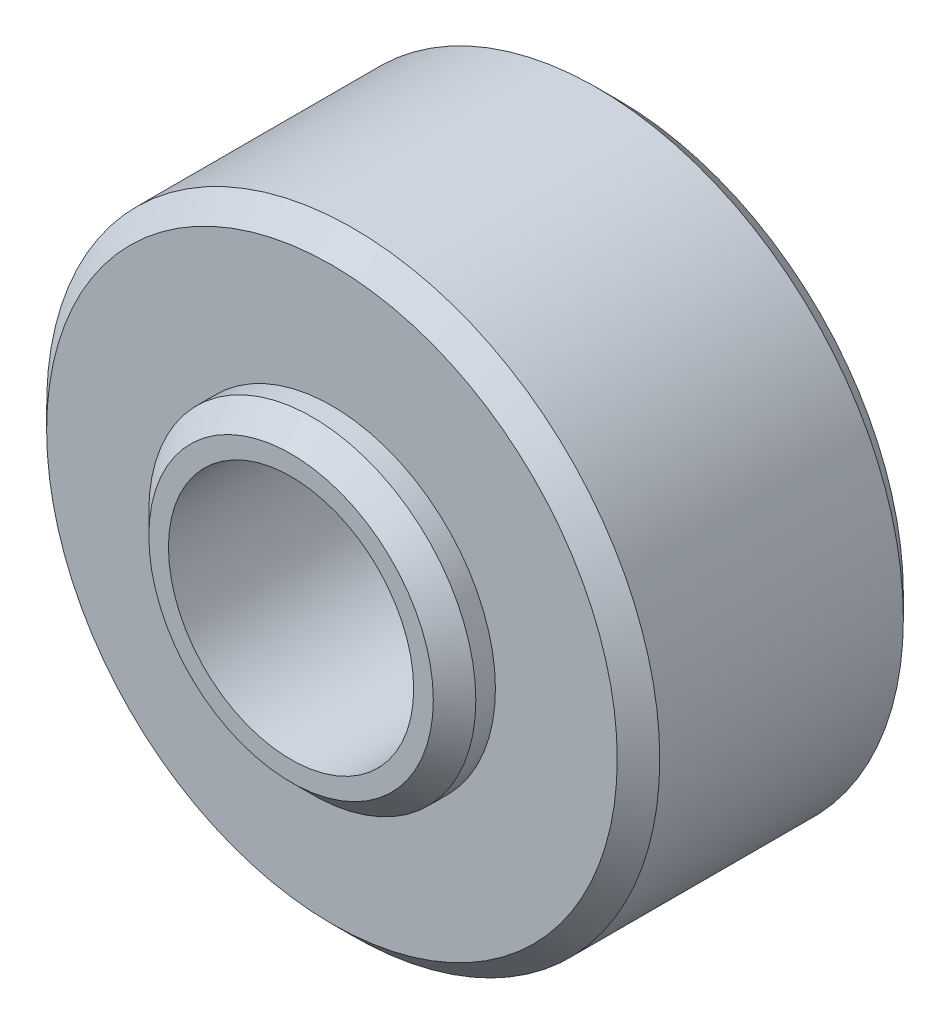
ISO-10303-21;
HEADER;
FILE_DESCRIPTION(('STEP AP214'),'2;1');
FILE_NAME('part.step','',(''),(''),'','','');
FILE_SCHEMA(('AUTOMOTIVE_DESIGN { 1 0 10303 214 1 1 1 1 }'));
ENDSEC;
DATA;
#1=APPLICATION_CONTEXT('core data for automotive mechanical design processes');
#2=APPLICATION_PROTOCOL_DEFINITION('international standard','automotive_design',2000,#1);
#3=PRODUCT_CONTEXT('',#1,'mechanical');
#4=PRODUCT('Part','Part','',(#3));
#5=PRODUCT_RELATED_PRODUCT_CATEGORY('part','',(#4));
#6=PRODUCT_DEFINITION_FORMATION('','',#4);
#7=PRODUCT_DEFINITION_CONTEXT('part definition',#1,'design');
#8=PRODUCT_DEFINITION('design','',#6,#7);
#9=PRODUCT_DEFINITION_SHAPE('','',#8);
#10=(LENGTH_UNIT() NAMED_UNIT(*) SI_UNIT(.MILLI.,.METRE.));
#11=(NAMED_UNIT(*) PLANE_ANGLE_UNIT() SI_UNIT($,.RADIAN.));
#12=(NAMED_UNIT(*) SI_UNIT($,.STERADIAN.) SOLID_ANGLE_UNIT());
#13=UNCERTAINTY_MEASURE_WITH_UNIT(LENGTH_MEASURE(1.E-05),#10,'distance_accuracy_value','');
#14=(GEOMETRIC_REPRESENTATION_CONTEXT(3) GLOBAL_UNCERTAINTY_ASSIGNED_CONTEXT((#13)) GLOBAL_UNIT_ASSIGNED_CONTEXT((#10,
#11,#12)) REPRESENTATION_CONTEXT('',''));
#15=CARTESIAN_POINT('',(0.,0.,0.));
#16=DIRECTION('',(0.,0.,1.));
#17=DIRECTION('',(1.,0.,0.));
#18=AXIS2_PLACEMENT_3D('',#15,#16,#17);
#19=CARTESIAN_POINT('',(0.,0.,7.));
#20=DIRECTION('',(0.,0.,-1.));
#21=DIRECTION('',(-1.,0.,0.));
#22=AXIS2_PLACEMENT_3D('',#19,#20,#21);
#23=CYLINDRICAL_SURFACE('',#22,7.5);
#24=CARTESIAN_POINT('',(0.,0.,6.48));
#25=DIRECTION('',(0.,0.,1.));
#26=DIRECTION('',(1.,0.,0.));
#27=AXIS2_PLACEMENT_3D('',#24,#25,#26);
#28=CIRCLE('',#27,7.5);
#29=CARTESIAN_POINT('',(7.5,0.,6.48));
#30=VERTEX_POINT('',#29);
#31=EDGE_CURVE('E10',#30,#30,#28,.F.);
#32=ORIENTED_EDGE('',*,*,#31,.T.);
#33=EDGE_LOOP('',(#32));
#34=FACE_BOUND('',#33,.T.);
#35=CARTESIAN_POINT('',(0.,0.,0.520000000000003));
#36=DIRECTION('',(0.,0.,1.));
#37=DIRECTION('',(1.,0.,0.));
#38=AXIS2_PLACEMENT_3D('',#35,#36,#37);
#39=CIRCLE('',#38,7.5);
#40=CARTESIAN_POINT('',(7.5,0.,0.520000000000003));
#41=VERTEX_POINT('',#40);
#42=EDGE_CURVE('E42',#41,#41,#39,.T.);
#43=ORIENTED_EDGE('',*,*,#42,.T.);
#44=EDGE_LOOP('',(#43));
#45=FACE_BOUND('',#44,.T.);
#46=ADVANCED_FACE('F34',(#34,#45),#23,.T.);
#47=CARTESIAN_POINT('',(0.,0.,7.));
#48=DIRECTION('',(0.,0.,1.));
#49=DIRECTION('',(1.,0.,0.));
#50=AXIS2_PLACEMENT_3D('',#47,#48,#49);
#51=PLANE('',#50);
#52=CARTESIAN_POINT('',(0.,0.,7.));
#53=DIRECTION('',(0.,0.,1.));
#54=DIRECTION('',(1.,0.,0.));
#55=AXIS2_PLACEMENT_3D('',#52,#53,#54);
#56=CIRCLE('',#55,6.97999999999999);
#57=CARTESIAN_POINT('',(6.97999999999999,0.,7.));
#58=VERTEX_POINT('',#57);
#59=EDGE_CURVE('E46',#58,#58,#56,.T.);
#60=ORIENTED_EDGE('',*,*,#59,.T.);
#61=EDGE_LOOP('',(#60));
#62=FACE_BOUND('',#61,.T.);
#63=CARTESIAN_POINT('',(0.,0.,7.));
#64=DIRECTION('',(0.,0.,1.));
#65=DIRECTION('',(1.,0.,0.));
#66=AXIS2_PLACEMENT_3D('',#63,#64,#65);
#67=CIRCLE('',#66,4.);
#68=CARTESIAN_POINT('',(4.,0.,7.));
#69=VERTEX_POINT('',#68);
#70=EDGE_CURVE('E67',#69,#69,#67,.T.);
#71=ORIENTED_EDGE('',*,*,#70,.F.);
#72=EDGE_LOOP('',(#71));
#73=FACE_BOUND('',#72,.T.);
#74=ADVANCED_FACE('F92',(#62,#73),#51,.T.);
#75=CARTESIAN_POINT('',(0.,0.,0.));
#76=DIRECTION('',(0.,0.,1.));
#77=DIRECTION('',(1.,0.,0.));
#78=AXIS2_PLACEMENT_3D('',#75,#76,#77);
#79=PLANE('',#78);
#80=CARTESIAN_POINT('',(0.,0.,0.));
#81=DIRECTION('',(0.,0.,1.));
#82=DIRECTION('',(1.,0.,0.));
#83=AXIS2_PLACEMENT_3D('',#80,#81,#82);
#84=CIRCLE('',#83,3.52000000000001);
#85=CARTESIAN_POINT('',(3.52000000000001,0.,0.));
#86=VERTEX_POINT('',#85);
#87=EDGE_CURVE('E61',#86,#86,#84,.T.);
#88=ORIENTED_EDGE('',*,*,#87,.T.);
#89=EDGE_LOOP('',(#88));
#90=FACE_BOUND('',#89,.T.);
#91=CARTESIAN_POINT('',(0.,0.,0.));
#92=DIRECTION('',(0.,0.,1.));
#93=DIRECTION('',(1.,0.,0.));
#94=AXIS2_PLACEMENT_3D('',#91,#92,#93);
#95=CIRCLE('',#94,6.98);
#96=CARTESIAN_POINT('',(6.98,0.,0.));
#97=VERTEX_POINT('',#96);
#98=EDGE_CURVE('E64',#97,#97,#95,.F.);
#99=ORIENTED_EDGE('',*,*,#98,.T.);
#100=EDGE_LOOP('',(#99));
#101=FACE_BOUND('',#100,.T.);
#102=ADVANCED_FACE('F88',(#90,#101),#79,.F.);
#103=CARTESIAN_POINT('',(0.,0.,8.));
#104=DIRECTION('',(0.,0.,-1.));
#105=DIRECTION('',(-1.,0.,0.));
#106=AXIS2_PLACEMENT_3D('',#103,#104,#105);
#107=CYLINDRICAL_SURFACE('',#106,4.);
#108=CARTESIAN_POINT('',(0.,0.,7.48));
#109=DIRECTION('',(0.,0.,1.));
#110=DIRECTION('',(1.,0.,0.));
#111=AXIS2_PLACEMENT_3D('',#108,#109,#110);
#112=CIRCLE('',#111,4.);
#113=CARTESIAN_POINT('',(4.,0.,7.48));
#114=VERTEX_POINT('',#113);
#115=EDGE_CURVE('E50',#114,#114,#112,.F.);
#116=ORIENTED_EDGE('',*,*,#115,.T.);
#117=EDGE_LOOP('',(#116));
#118=FACE_BOUND('',#117,.T.);
#119=ORIENTED_EDGE('',*,*,#70,.T.);
#120=EDGE_LOOP('',(#119));
#121=FACE_BOUND('',#120,.T.);
#122=ADVANCED_FACE('F78',(#118,#121),#107,.T.);
#123=CARTESIAN_POINT('',(0.,0.,8.));
#124=DIRECTION('',(0.,0.,1.));
#125=DIRECTION('',(1.,0.,0.));
#126=AXIS2_PLACEMENT_3D('',#123,#124,#125);
#127=PLANE('',#126);
#128=CARTESIAN_POINT('',(0.,0.,8.));
#129=DIRECTION('',(0.,0.,1.));
#130=DIRECTION('',(1.,0.,0.));
#131=AXIS2_PLACEMENT_3D('',#128,#129,#130);
#132=CIRCLE('',#131,3.48);
#133=CARTESIAN_POINT('',(3.48,0.,8.));
#134=VERTEX_POINT('',#133);
#135=EDGE_CURVE('E55',#134,#134,#132,.T.);
#136=ORIENTED_EDGE('',*,*,#135,.T.);
#137=EDGE_LOOP('',(#136));
#138=FACE_BOUND('',#137,.T.);
#139=CARTESIAN_POINT('',(0.,0.,8.));
#140=DIRECTION('',(0.,0.,1.));
#141=DIRECTION('',(1.,0.,0.));
#142=AXIS2_PLACEMENT_3D('',#139,#140,#141);
#143=CIRCLE('',#142,3.);
#144=CARTESIAN_POINT('',(3.,0.,8.));
#145=VERTEX_POINT('',#144);
#146=EDGE_CURVE('E70',#145,#145,#143,.T.);
#147=ORIENTED_EDGE('',*,*,#146,.F.);
#148=EDGE_LOOP('',(#147));
#149=FACE_BOUND('',#148,.T.);
#150=ADVANCED_FACE('F76',(#138,#149),#127,.T.);
#151=CARTESIAN_POINT('',(0.,0.,0.));
#152=DIRECTION('',(0.,0.,1.));
#153=DIRECTION('',(1.,0.,0.));
#154=AXIS2_PLACEMENT_3D('',#151,#152,#153);
#155=CYLINDRICAL_SURFACE('',#154,3.);
#156=CARTESIAN_POINT('',(0.,0.,0.520000000000004));
#157=DIRECTION('',(0.,0.,1.));
#158=DIRECTION('',(1.,0.,0.));
#159=AXIS2_PLACEMENT_3D('',#156,#157,#158);
#160=CIRCLE('',#159,3.);
#161=CARTESIAN_POINT('',(3.,0.,0.520000000000004));
#162=VERTEX_POINT('',#161);
#163=EDGE_CURVE('E58',#162,#162,#160,.F.);
#164=ORIENTED_EDGE('',*,*,#163,.T.);
#165=EDGE_LOOP('',(#164));
#166=FACE_BOUND('',#165,.T.);
#167=ORIENTED_EDGE('',*,*,#146,.T.);
#168=EDGE_LOOP('',(#167));
#169=FACE_BOUND('',#168,.T.);
#170=ADVANCED_FACE('F74',(#166,#169),#155,.F.);
#171=CARTESIAN_POINT('',(0.,0.,0.));
#172=DIRECTION('',(0.,0.,-1.));
#173=DIRECTION('',(-1.,0.,0.));
#174=AXIS2_PLACEMENT_3D('',#171,#172,#173);
#175=CONICAL_SURFACE('',#174,3.52000000000001,0.785398163397449);
#176=ORIENTED_EDGE('',*,*,#163,.F.);
#177=EDGE_LOOP('',(#176));
#178=FACE_BOUND('',#177,.T.);
#179=ORIENTED_EDGE('',*,*,#87,.F.);
#180=EDGE_LOOP('',(#179));
#181=FACE_BOUND('',#180,.T.);
#182=ADVANCED_FACE('F85',(#178,#181),#175,.F.);
#183=CARTESIAN_POINT('',(0.,0.,8.));
#184=DIRECTION('',(0.,0.,-1.));
#185=DIRECTION('',(-1.,0.,0.));
#186=AXIS2_PLACEMENT_3D('',#183,#184,#185);
#187=CONICAL_SURFACE('',#186,3.48,0.785398163397447);
#188=ORIENTED_EDGE('',*,*,#115,.F.);
#189=EDGE_LOOP('',(#188));
#190=FACE_BOUND('',#189,.T.);
#191=ORIENTED_EDGE('',*,*,#135,.F.);
#192=EDGE_LOOP('',(#191));
#193=FACE_BOUND('',#192,.T.);
#194=ADVANCED_FACE('F107',(#190,#193),#187,.T.);
#195=CARTESIAN_POINT('',(0.,0.,7.));
#196=DIRECTION('',(0.,0.,-1.));
#197=DIRECTION('',(-1.,0.,0.));
#198=AXIS2_PLACEMENT_3D('',#195,#196,#197);
#199=CONICAL_SURFACE('',#198,6.97999999999999,0.785398163397451);
#200=ORIENTED_EDGE('',*,*,#31,.F.);
#201=EDGE_LOOP('',(#200));
#202=FACE_BOUND('',#201,.T.);
#203=ORIENTED_EDGE('',*,*,#59,.F.);
#204=EDGE_LOOP('',(#203));
#205=FACE_BOUND('',#204,.T.);
#206=ADVANCED_FACE('F113',(#202,#205),#199,.T.);
#207=CARTESIAN_POINT('',(0.,0.,0.520000000000003));
#208=DIRECTION('',(0.,0.,1.));
#209=DIRECTION('',(1.,0.,0.));
#210=AXIS2_PLACEMENT_3D('',#207,#208,#209);
#211=CONICAL_SURFACE('',#210,7.5,0.785398163397448);
#212=ORIENTED_EDGE('',*,*,#98,.F.);
#213=EDGE_LOOP('',(#212));
#214=FACE_BOUND('',#213,.T.);
#215=ORIENTED_EDGE('',*,*,#42,.F.);
#216=EDGE_LOOP('',(#215));
#217=FACE_BOUND('',#216,.T.);
#218=ADVANCED_FACE('F37',(#214,#217),#211,.T.);
#219=CLOSED_SHELL('',(#46,#74,#102,#122,#150,#170,#182,#194,#206,#218));
#220=MANIFOLD_SOLID_BREP('B2',#219);
#221=ADVANCED_BREP_SHAPE_REPRESENTATION('',(#18,#220),#14);
#222=SHAPE_DEFINITION_REPRESENTATION(#9,#221);
ENDSEC;
END-ISO-10303-21;
